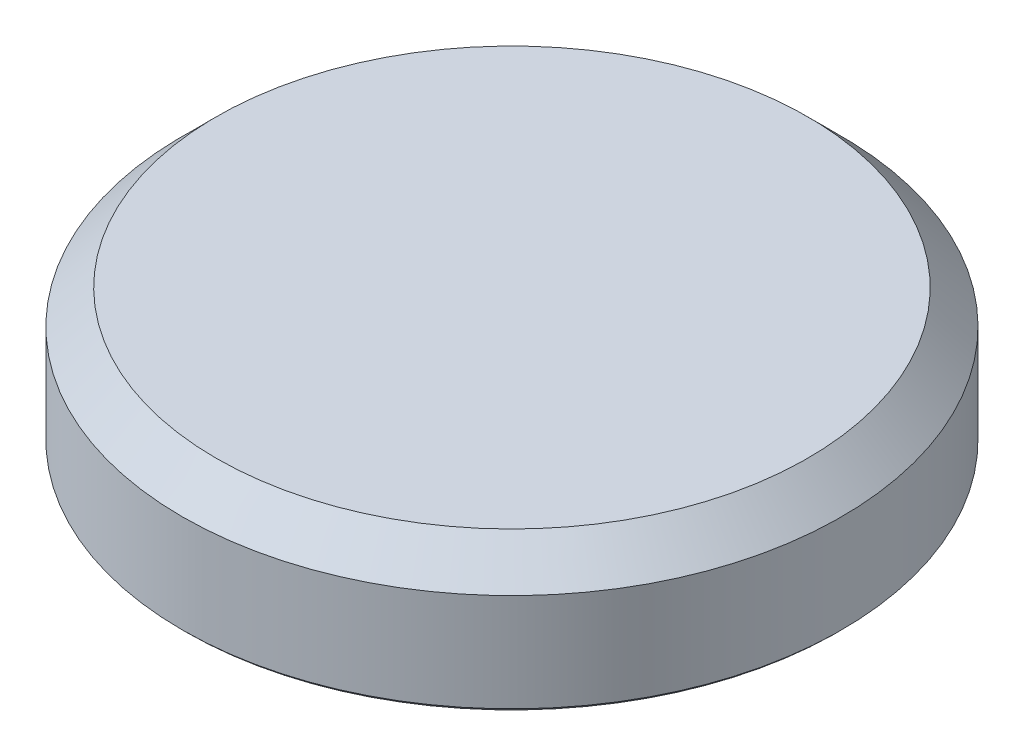
ISO-10303-21;
HEADER;
FILE_DESCRIPTION(('STEP AP214'),'2;1');
FILE_NAME('part.step','',(''),(''),'','','');
FILE_SCHEMA(('AUTOMOTIVE_DESIGN { 1 0 10303 214 1 1 1 1 }'));
ENDSEC;
DATA;
#1=APPLICATION_CONTEXT('core data for automotive mechanical design processes');
#2=APPLICATION_PROTOCOL_DEFINITION('international standard','automotive_design',2000,#1);
#3=PRODUCT_CONTEXT('',#1,'mechanical');
#4=PRODUCT('Part','Part','',(#3));
#5=PRODUCT_RELATED_PRODUCT_CATEGORY('part','',(#4));
#6=PRODUCT_DEFINITION_FORMATION('','',#4);
#7=PRODUCT_DEFINITION_CONTEXT('part definition',#1,'design');
#8=PRODUCT_DEFINITION('design','',#6,#7);
#9=PRODUCT_DEFINITION_SHAPE('','',#8);
#10=(LENGTH_UNIT() NAMED_UNIT(*) SI_UNIT(.MILLI.,.METRE.));
#11=(NAMED_UNIT(*) PLANE_ANGLE_UNIT() SI_UNIT($,.RADIAN.));
#12=(NAMED_UNIT(*) SI_UNIT($,.STERADIAN.) SOLID_ANGLE_UNIT());
#13=UNCERTAINTY_MEASURE_WITH_UNIT(LENGTH_MEASURE(1.E-05),#10,'distance_accuracy_value','');
#14=(GEOMETRIC_REPRESENTATION_CONTEXT(3) GLOBAL_UNCERTAINTY_ASSIGNED_CONTEXT((#13)) GLOBAL_UNIT_ASSIGNED_CONTEXT((#10,
#11,#12)) REPRESENTATION_CONTEXT('',''));
#15=CARTESIAN_POINT('',(0.,0.,0.));
#16=DIRECTION('',(0.,0.,1.));
#17=DIRECTION('',(1.,0.,0.));
#18=AXIS2_PLACEMENT_3D('',#15,#16,#17);
#19=CARTESIAN_POINT('',(0.,10.16,0.));
#20=DIRECTION('',(0.,-1.,0.));
#21=DIRECTION('',(0.,0.,-1.));
#22=AXIS2_PLACEMENT_3D('',#19,#20,#21);
#23=CYLINDRICAL_SURFACE('',#22,24.765);
#24=CARTESIAN_POINT('',(0.,0.254000000000004,0.));
#25=DIRECTION('',(0.,1.,0.));
#26=DIRECTION('',(0.,0.,1.));
#27=AXIS2_PLACEMENT_3D('',#24,#25,#26);
#28=CIRCLE('',#27,24.765);
#29=CARTESIAN_POINT('',(0.,0.254000000000004,24.765));
#30=VERTEX_POINT('',#29);
#31=EDGE_CURVE('E57',#30,#30,#28,.T.);
#32=ORIENTED_EDGE('',*,*,#31,.T.);
#33=EDGE_LOOP('',(#32));
#34=FACE_BOUND('',#33,.T.);
#35=CARTESIAN_POINT('',(0.,7.62,0.));
#36=DIRECTION('',(0.,1.,0.));
#37=DIRECTION('',(0.,0.,1.));
#38=AXIS2_PLACEMENT_3D('',#35,#36,#37);
#39=CIRCLE('',#38,24.765);
#40=CARTESIAN_POINT('',(0.,7.62,24.765));
#41=VERTEX_POINT('',#40);
#42=EDGE_CURVE('E126',#41,#41,#39,.F.);
#43=ORIENTED_EDGE('',*,*,#42,.T.);
#44=EDGE_LOOP('',(#43));
#45=FACE_BOUND('',#44,.T.);
#46=ADVANCED_FACE('F47',(#34,#45),#23,.T.);
#47=CARTESIAN_POINT('',(0.,10.16,0.));
#48=DIRECTION('',(0.,1.,0.));
#49=DIRECTION('',(0.,0.,1.));
#50=AXIS2_PLACEMENT_3D('',#47,#48,#49);
#51=PLANE('',#50);
#52=CARTESIAN_POINT('',(0.,10.16,0.));
#53=DIRECTION('',(0.,1.,0.));
#54=DIRECTION('',(0.,0.,1.));
#55=AXIS2_PLACEMENT_3D('',#52,#53,#54);
#56=CIRCLE('',#55,22.225);
#57=CARTESIAN_POINT('',(0.,10.16,22.225));
#58=VERTEX_POINT('',#57);
#59=EDGE_CURVE('E122',#58,#58,#56,.T.);
#60=ORIENTED_EDGE('',*,*,#59,.T.);
#61=EDGE_LOOP('',(#60));
#62=FACE_BOUND('',#61,.T.);
#63=ADVANCED_FACE('F149',(#62),#51,.T.);
#64=CARTESIAN_POINT('',(0.,0.,0.));
#65=DIRECTION('',(0.,1.,0.));
#66=DIRECTION('',(0.,0.,1.));
#67=AXIS2_PLACEMENT_3D('',#64,#65,#66);
#68=PLANE('',#67);
#69=CARTESIAN_POINT('',(0.,0.,0.));
#70=DIRECTION('',(0.,-1.,0.));
#71=DIRECTION('',(0.,0.,-1.));
#72=AXIS2_PLACEMENT_3D('',#69,#70,#71);
#73=CIRCLE('',#72,3.175);
#74=CARTESIAN_POINT('',(0.,0.,-3.175));
#75=VERTEX_POINT('',#74);
#76=EDGE_CURVE('E85',#75,#75,#73,.T.);
#77=ORIENTED_EDGE('',*,*,#76,.F.);
#78=EDGE_LOOP('',(#77));
#79=FACE_BOUND('',#78,.T.);
#80=CARTESIAN_POINT('',(4.93914086658831,0.,-4.93914086658831));
#81=DIRECTION('',(0.,-1.,0.));
#82=DIRECTION('',(0.,0.,-1.));
#83=AXIS2_PLACEMENT_3D('',#80,#81,#82);
#84=CIRCLE('',#83,3.02259999999999);
#85=CARTESIAN_POINT('',(4.93914086658831,0.,-7.9617408665883));
#86=VERTEX_POINT('',#85);
#87=EDGE_CURVE('E84',#86,#86,#84,.T.);
#88=ORIENTED_EDGE('',*,*,#87,.F.);
#89=EDGE_LOOP('',(#88));
#90=FACE_BOUND('',#89,.T.);
#91=CARTESIAN_POINT('',(-4.93914086658804,0.,-4.93914086658831));
#92=DIRECTION('',(0.,-1.,0.));
#93=DIRECTION('',(0.,0.,-1.));
#94=AXIS2_PLACEMENT_3D('',#91,#92,#93);
#95=CIRCLE('',#94,3.02259999999999);
#96=CARTESIAN_POINT('',(-4.93914086658804,0.,-7.9617408665883));
#97=VERTEX_POINT('',#96);
#98=EDGE_CURVE('E98',#97,#97,#95,.T.);
#99=ORIENTED_EDGE('',*,*,#98,.F.);
#100=EDGE_LOOP('',(#99));
#101=FACE_BOUND('',#100,.T.);
#102=CARTESIAN_POINT('',(-4.93914086658804,0.,4.93914086658804));
#103=DIRECTION('',(0.,-1.,0.));
#104=DIRECTION('',(0.,0.,-1.));
#105=AXIS2_PLACEMENT_3D('',#102,#103,#104);
#106=CIRCLE('',#105,3.02259999999999);
#107=CARTESIAN_POINT('',(-4.93914086658804,0.,1.91654086658805));
#108=VERTEX_POINT('',#107);
#109=EDGE_CURVE('E106',#108,#108,#106,.T.);
#110=ORIENTED_EDGE('',*,*,#109,.F.);
#111=EDGE_LOOP('',(#110));
#112=FACE_BOUND('',#111,.T.);
#113=CARTESIAN_POINT('',(4.93914086658831,0.,4.93914086658803));
#114=DIRECTION('',(0.,-1.,0.));
#115=DIRECTION('',(0.,0.,-1.));
#116=AXIS2_PLACEMENT_3D('',#113,#114,#115);
#117=CIRCLE('',#116,3.02259999999999);
#118=CARTESIAN_POINT('',(4.93914086658831,0.,1.91654086658804));
#119=VERTEX_POINT('',#118);
#120=EDGE_CURVE('E114',#119,#119,#117,.T.);
#121=ORIENTED_EDGE('',*,*,#120,.F.);
#122=EDGE_LOOP('',(#121));
#123=FACE_BOUND('',#122,.T.);
#124=CARTESIAN_POINT('',(0.,0.,0.));
#125=DIRECTION('',(0.,1.,0.));
#126=DIRECTION('',(0.,0.,1.));
#127=AXIS2_PLACEMENT_3D('',#124,#125,#126);
#128=CIRCLE('',#127,24.511);
#129=CARTESIAN_POINT('',(0.,0.,24.511));
#130=VERTEX_POINT('',#129);
#131=EDGE_CURVE('E11',#130,#130,#128,.F.);
#132=ORIENTED_EDGE('',*,*,#131,.T.);
#133=EDGE_LOOP('',(#132));
#134=FACE_BOUND('',#133,.T.);
#135=ADVANCED_FACE('F146',(#79,#90,#101,#112,#123,#134),#68,.F.);
#136=CARTESIAN_POINT('',(0.,10.16,0.));
#137=DIRECTION('',(0.,-1.,0.));
#138=DIRECTION('',(0.,0.,-1.));
#139=AXIS2_PLACEMENT_3D('',#136,#137,#138);
#140=CONICAL_SURFACE('',#139,22.225,0.785398163397445);
#141=ORIENTED_EDGE('',*,*,#42,.F.);
#142=EDGE_LOOP('',(#141));
#143=FACE_BOUND('',#142,.T.);
#144=ORIENTED_EDGE('',*,*,#59,.F.);
#145=EDGE_LOOP('',(#144));
#146=FACE_BOUND('',#145,.T.);
#147=ADVANCED_FACE('F137',(#143,#146),#140,.T.);
#148=CARTESIAN_POINT('',(0.,0.254000000000004,0.));
#149=DIRECTION('',(0.,1.,0.));
#150=DIRECTION('',(0.,0.,1.));
#151=AXIS2_PLACEMENT_3D('',#148,#149,#150);
#152=CONICAL_SURFACE('',#151,24.765,0.785398163397455);
#153=ORIENTED_EDGE('',*,*,#131,.F.);
#154=EDGE_LOOP('',(#153));
#155=FACE_BOUND('',#154,.T.);
#156=ORIENTED_EDGE('',*,*,#31,.F.);
#157=EDGE_LOOP('',(#156));
#158=FACE_BOUND('',#157,.T.);
#159=ADVANCED_FACE('F50',(#155,#158),#152,.T.);
#160=CARTESIAN_POINT('',(4.93914086658831,3.81,4.93914086658803));
#161=DIRECTION('',(0.,-1.,0.));
#162=DIRECTION('',(0.,0.,-1.));
#163=AXIS2_PLACEMENT_3D('',#160,#161,#162);
#164=CONICAL_SURFACE('',#163,3.0226,1.02974425867665);
#165=CARTESIAN_POINT('',(4.93914086658831,5.6261613070727,4.93914086658803));
#166=VERTEX_POINT('',#165);
#167=VERTEX_LOOP('',#166);
#168=FACE_BOUND('',#167,.T.);
#169=CARTESIAN_POINT('',(4.93914086658831,3.81,4.93914086658803));
#170=DIRECTION('',(0.,-1.,0.));
#171=DIRECTION('',(0.,0.,-1.));
#172=AXIS2_PLACEMENT_3D('',#169,#170,#171);
#173=CIRCLE('',#172,3.0226);
#174=CARTESIAN_POINT('',(4.93914086658831,3.81,1.91654086658804));
#175=VERTEX_POINT('',#174);
#176=EDGE_CURVE('E118',#175,#175,#173,.T.);
#177=ORIENTED_EDGE('',*,*,#176,.T.);
#178=EDGE_LOOP('',(#177));
#179=FACE_BOUND('',#178,.T.);
#180=ADVANCED_FACE('F136',(#168,#179),#164,.F.);
#181=CARTESIAN_POINT('',(4.93914086658831,0.,4.93914086658803));
#182=DIRECTION('',(0.,-1.,0.));
#183=DIRECTION('',(0.,0.,-1.));
#184=AXIS2_PLACEMENT_3D('',#181,#182,#183);
#185=CYLINDRICAL_SURFACE('',#184,3.02259999999999);
#186=ORIENTED_EDGE('',*,*,#176,.F.);
#187=EDGE_LOOP('',(#186));
#188=FACE_BOUND('',#187,.T.);
#189=ORIENTED_EDGE('',*,*,#120,.T.);
#190=EDGE_LOOP('',(#189));
#191=FACE_BOUND('',#190,.T.);
#192=ADVANCED_FACE('F143',(#188,#191),#185,.F.);
#193=CARTESIAN_POINT('',(-4.93914086658804,3.81,4.93914086658804));
#194=DIRECTION('',(0.,-1.,0.));
#195=DIRECTION('',(0.,0.,-1.));
#196=AXIS2_PLACEMENT_3D('',#193,#194,#195);
#197=CONICAL_SURFACE('',#196,3.0226,1.02974425867665);
#198=CARTESIAN_POINT('',(-4.93914086658804,5.6261613070727,4.93914086658804));
#199=VERTEX_POINT('',#198);
#200=VERTEX_LOOP('',#199);
#201=FACE_BOUND('',#200,.T.);
#202=CARTESIAN_POINT('',(-4.93914086658804,3.81,4.93914086658804));
#203=DIRECTION('',(0.,-1.,0.));
#204=DIRECTION('',(0.,0.,-1.));
#205=AXIS2_PLACEMENT_3D('',#202,#203,#204);
#206=CIRCLE('',#205,3.0226);
#207=CARTESIAN_POINT('',(-4.93914086658804,3.81,1.91654086658804));
#208=VERTEX_POINT('',#207);
#209=EDGE_CURVE('E110',#208,#208,#206,.T.);
#210=ORIENTED_EDGE('',*,*,#209,.T.);
#211=EDGE_LOOP('',(#210));
#212=FACE_BOUND('',#211,.T.);
#213=ADVANCED_FACE('F167',(#201,#212),#197,.F.);
#214=CARTESIAN_POINT('',(-4.93914086658804,0.,4.93914086658804));
#215=DIRECTION('',(0.,-1.,0.));
#216=DIRECTION('',(0.,0.,-1.));
#217=AXIS2_PLACEMENT_3D('',#214,#215,#216);
#218=CYLINDRICAL_SURFACE('',#217,3.02259999999999);
#219=ORIENTED_EDGE('',*,*,#209,.F.);
#220=EDGE_LOOP('',(#219));
#221=FACE_BOUND('',#220,.T.);
#222=ORIENTED_EDGE('',*,*,#109,.T.);
#223=EDGE_LOOP('',(#222));
#224=FACE_BOUND('',#223,.T.);
#225=ADVANCED_FACE('F171',(#221,#224),#218,.F.);
#226=CARTESIAN_POINT('',(-4.93914086658804,3.81,-4.93914086658831));
#227=DIRECTION('',(0.,-1.,0.));
#228=DIRECTION('',(0.,0.,-1.));
#229=AXIS2_PLACEMENT_3D('',#226,#227,#228);
#230=CONICAL_SURFACE('',#229,3.0226,1.02974425867665);
#231=CARTESIAN_POINT('',(-4.93914086658804,5.6261613070727,-4.93914086658831));
#232=VERTEX_POINT('',#231);
#233=VERTEX_LOOP('',#232);
#234=FACE_BOUND('',#233,.T.);
#235=CARTESIAN_POINT('',(-4.93914086658804,3.81,-4.93914086658831));
#236=DIRECTION('',(0.,-1.,0.));
#237=DIRECTION('',(0.,0.,-1.));
#238=AXIS2_PLACEMENT_3D('',#235,#236,#237);
#239=CIRCLE('',#238,3.0226);
#240=CARTESIAN_POINT('',(-4.93914086658804,3.81,-7.96174086658831));
#241=VERTEX_POINT('',#240);
#242=EDGE_CURVE('E102',#241,#241,#239,.T.);
#243=ORIENTED_EDGE('',*,*,#242,.T.);
#244=EDGE_LOOP('',(#243));
#245=FACE_BOUND('',#244,.T.);
#246=ADVANCED_FACE('F174',(#234,#245),#230,.F.);
#247=CARTESIAN_POINT('',(-4.93914086658804,0.,-4.93914086658831));
#248=DIRECTION('',(0.,-1.,0.));
#249=DIRECTION('',(0.,0.,-1.));
#250=AXIS2_PLACEMENT_3D('',#247,#248,#249);
#251=CYLINDRICAL_SURFACE('',#250,3.02259999999999);
#252=ORIENTED_EDGE('',*,*,#242,.F.);
#253=EDGE_LOOP('',(#252));
#254=FACE_BOUND('',#253,.T.);
#255=ORIENTED_EDGE('',*,*,#98,.T.);
#256=EDGE_LOOP('',(#255));
#257=FACE_BOUND('',#256,.T.);
#258=ADVANCED_FACE('F178',(#254,#257),#251,.F.);
#259=CARTESIAN_POINT('',(4.93914086658831,3.81,-4.93914086658831));
#260=DIRECTION('',(0.,-1.,0.));
#261=DIRECTION('',(0.,0.,-1.));
#262=AXIS2_PLACEMENT_3D('',#259,#260,#261);
#263=CONICAL_SURFACE('',#262,3.0226,1.02974425867665);
#264=CARTESIAN_POINT('',(4.93914086658831,5.6261613070727,-4.93914086658831));
#265=VERTEX_POINT('',#264);
#266=VERTEX_LOOP('',#265);
#267=FACE_BOUND('',#266,.T.);
#268=CARTESIAN_POINT('',(4.93914086658831,3.81,-4.93914086658831));
#269=DIRECTION('',(0.,-1.,0.));
#270=DIRECTION('',(0.,0.,-1.));
#271=AXIS2_PLACEMENT_3D('',#268,#269,#270);
#272=CIRCLE('',#271,3.0226);
#273=CARTESIAN_POINT('',(4.93914086658831,3.81,-7.96174086658831));
#274=VERTEX_POINT('',#273);
#275=EDGE_CURVE('E90',#274,#274,#272,.T.);
#276=ORIENTED_EDGE('',*,*,#275,.T.);
#277=EDGE_LOOP('',(#276));
#278=FACE_BOUND('',#277,.T.);
#279=ADVANCED_FACE('F182',(#267,#278),#263,.F.);
#280=CARTESIAN_POINT('',(4.93914086658831,0.,-4.93914086658831));
#281=DIRECTION('',(0.,-1.,0.));
#282=DIRECTION('',(0.,0.,-1.));
#283=AXIS2_PLACEMENT_3D('',#280,#281,#282);
#284=CYLINDRICAL_SURFACE('',#283,3.02259999999999);
#285=ORIENTED_EDGE('',*,*,#275,.F.);
#286=EDGE_LOOP('',(#285));
#287=FACE_BOUND('',#286,.T.);
#288=ORIENTED_EDGE('',*,*,#87,.T.);
#289=EDGE_LOOP('',(#288));
#290=FACE_BOUND('',#289,.T.);
#291=ADVANCED_FACE('F77',(#287,#290),#284,.F.);
#292=CARTESIAN_POINT('',(0.,7.62,0.));
#293=DIRECTION('',(0.,-1.,0.));
#294=DIRECTION('',(0.,0.,-1.));
#295=AXIS2_PLACEMENT_3D('',#292,#293,#294);
#296=CONICAL_SURFACE('',#295,3.175,1.02974425867665);
#297=CARTESIAN_POINT('',(0.,9.52773246541251,0.));
#298=VERTEX_POINT('',#297);
#299=VERTEX_LOOP('',#298);
#300=FACE_BOUND('',#299,.T.);
#301=CARTESIAN_POINT('',(0.,7.62,0.));
#302=DIRECTION('',(0.,-1.,0.));
#303=DIRECTION('',(0.,0.,-1.));
#304=AXIS2_PLACEMENT_3D('',#301,#302,#303);
#305=CIRCLE('',#304,3.175);
#306=CARTESIAN_POINT('',(0.,7.62,-3.175));
#307=VERTEX_POINT('',#306);
#308=EDGE_CURVE('E81',#307,#307,#305,.T.);
#309=ORIENTED_EDGE('',*,*,#308,.T.);
#310=EDGE_LOOP('',(#309));
#311=FACE_BOUND('',#310,.T.);
#312=ADVANCED_FACE('F73',(#300,#311),#296,.F.);
#313=CARTESIAN_POINT('',(0.,0.,0.));
#314=DIRECTION('',(0.,-1.,0.));
#315=DIRECTION('',(0.,0.,-1.));
#316=AXIS2_PLACEMENT_3D('',#313,#314,#315);
#317=CYLINDRICAL_SURFACE('',#316,3.175);
#318=ORIENTED_EDGE('',*,*,#308,.F.);
#319=EDGE_LOOP('',(#318));
#320=FACE_BOUND('',#319,.T.);
#321=ORIENTED_EDGE('',*,*,#76,.T.);
#322=EDGE_LOOP('',(#321));
#323=FACE_BOUND('',#322,.T.);
#324=ADVANCED_FACE('F76',(#320,#323),#317,.F.);
#325=CLOSED_SHELL('',(#46,#63,#135,#147,#159,#180,#192,#213,#225,#246,#258,#279,#291,#312,#324));
#326=MANIFOLD_SOLID_BREP('B2',#325);
#327=ADVANCED_BREP_SHAPE_REPRESENTATION('',(#18,#326),#14);
#328=SHAPE_DEFINITION_REPRESENTATION(#9,#327);
ENDSEC;
END-ISO-10303-21;
